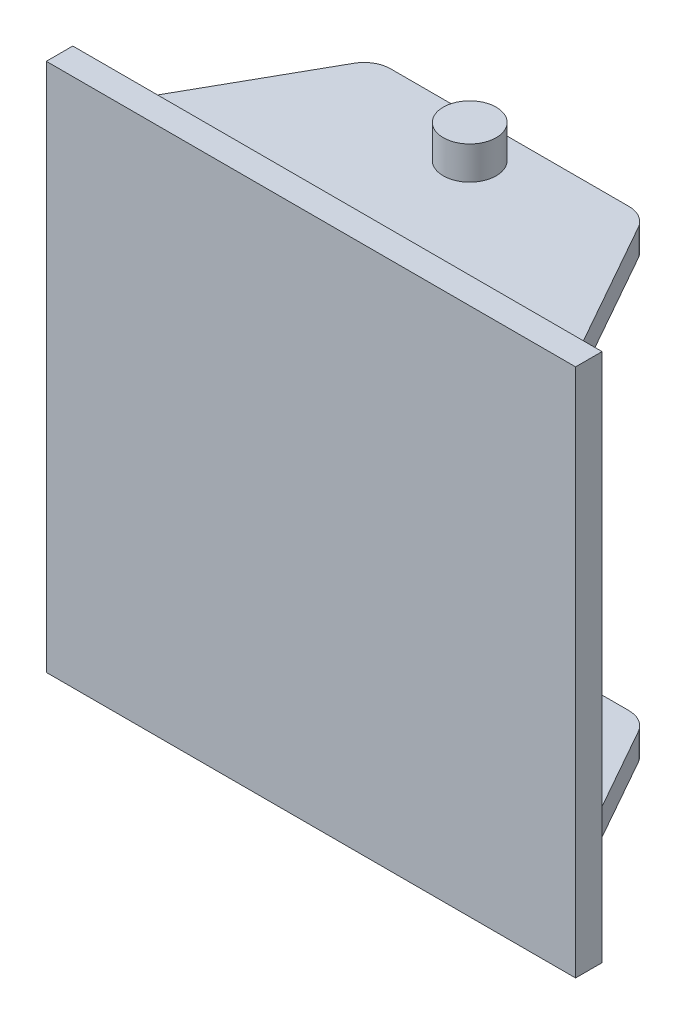
ISO-10303-21;
HEADER;
FILE_DESCRIPTION(('STEP AP214'),'2;1');
FILE_NAME('part.step','',(''),(''),'','','');
FILE_SCHEMA(('AUTOMOTIVE_DESIGN { 1 0 10303 214 1 1 1 1 }'));
ENDSEC;
DATA;
#1=APPLICATION_CONTEXT('core data for automotive mechanical design processes');
#2=APPLICATION_PROTOCOL_DEFINITION('international standard','automotive_design',2000,#1);
#3=PRODUCT_CONTEXT('',#1,'mechanical');
#4=PRODUCT('Part','Part','',(#3));
#5=PRODUCT_RELATED_PRODUCT_CATEGORY('part','',(#4));
#6=PRODUCT_DEFINITION_FORMATION('','',#4);
#7=PRODUCT_DEFINITION_CONTEXT('part definition',#1,'design');
#8=PRODUCT_DEFINITION('design','',#6,#7);
#9=PRODUCT_DEFINITION_SHAPE('','',#8);
#10=(LENGTH_UNIT() NAMED_UNIT(*) SI_UNIT(.MILLI.,.METRE.));
#11=(NAMED_UNIT(*) PLANE_ANGLE_UNIT() SI_UNIT($,.RADIAN.));
#12=(NAMED_UNIT(*) SI_UNIT($,.STERADIAN.) SOLID_ANGLE_UNIT());
#13=UNCERTAINTY_MEASURE_WITH_UNIT(LENGTH_MEASURE(1.E-05),#10,'distance_accuracy_value','');
#14=(GEOMETRIC_REPRESENTATION_CONTEXT(3) GLOBAL_UNCERTAINTY_ASSIGNED_CONTEXT((#13)) GLOBAL_UNIT_ASSIGNED_CONTEXT((#10,
#11,#12)) REPRESENTATION_CONTEXT('',''));
#15=CARTESIAN_POINT('',(0.,0.,0.));
#16=DIRECTION('',(0.,0.,1.));
#17=DIRECTION('',(1.,0.,0.));
#18=AXIS2_PLACEMENT_3D('',#15,#16,#17);
#19=CARTESIAN_POINT('',(45.,-100.,-55.0933602375957));
#20=DIRECTION('',(0.,1.,0.));
#21=DIRECTION('',(-1.,0.,0.));
#22=AXIS2_PLACEMENT_3D('',#19,#20,#21);
#23=CYLINDRICAL_SURFACE('',#22,10.);
#24=DIRECTION('',(0.,1.,0.));
#25=VECTOR('',#24,1.);
#26=CARTESIAN_POINT('',(45.,-100.,-65.0933602375957));
#27=LINE('',#26,#25);
#28=CARTESIAN_POINT('',(45.,-87.5,-65.0933602375957));
#29=VERTEX_POINT('',#28);
#30=CARTESIAN_POINT('',(45.,-77.5,-65.0933602375958));
#31=VERTEX_POINT('',#30);
#32=EDGE_CURVE('E193',#29,#31,#27,.T.);
#33=ORIENTED_EDGE('',*,*,#32,.T.);
#34=CARTESIAN_POINT('',(45.,-77.5,-55.0933602375957));
#35=DIRECTION('',(0.,-1.,0.));
#36=DIRECTION('',(0.,0.,-1.));
#37=AXIS2_PLACEMENT_3D('',#34,#35,#36);
#38=CIRCLE('',#37,10.);
#39=CARTESIAN_POINT('',(53.7134887526176,-77.5,-60.));
#40=VERTEX_POINT('',#39);
#41=EDGE_CURVE('E321',#31,#40,#38,.T.);
#42=ORIENTED_EDGE('',*,*,#41,.T.);
#43=DIRECTION('',(0.,1.,0.));
#44=VECTOR('',#43,1.);
#45=CARTESIAN_POINT('',(53.7134887526176,-100.,-60.));
#46=LINE('',#45,#44);
#47=CARTESIAN_POINT('',(53.7134887526176,-87.5,-60.));
#48=VERTEX_POINT('',#47);
#49=EDGE_CURVE('E201',#48,#40,#46,.T.);
#50=ORIENTED_EDGE('',*,*,#49,.F.);
#51=CARTESIAN_POINT('',(45.,-87.5,-55.0933602375957));
#52=DIRECTION('',(0.,1.,0.));
#53=DIRECTION('',(-1.,0.,0.));
#54=AXIS2_PLACEMENT_3D('',#51,#52,#53);
#55=CIRCLE('',#54,10.);
#56=EDGE_CURVE('E209',#29,#48,#55,.F.);
#57=ORIENTED_EDGE('',*,*,#56,.F.);
#58=EDGE_LOOP('',(#33,#42,#50,#57));
#59=FACE_BOUND('',#58,.T.);
#60=ADVANCED_FACE('F39',(#59),#23,.T.);
#61=CARTESIAN_POINT('',(-45.,-100.,-65.0933602375957));
#62=DIRECTION('',(0.,0.,1.));
#63=DIRECTION('',(1.,0.,0.));
#64=AXIS2_PLACEMENT_3D('',#61,#62,#63);
#65=PLANE('',#64);
#66=DIRECTION('',(0.,1.,0.));
#67=VECTOR('',#66,1.);
#68=CARTESIAN_POINT('',(-45.,-100.,-65.0933602375957));
#69=LINE('',#68,#67);
#70=CARTESIAN_POINT('',(-45.,-87.5,-65.0933602375957));
#71=VERTEX_POINT('',#70);
#72=CARTESIAN_POINT('',(-45.,-77.5,-65.0933602375958));
#73=VERTEX_POINT('',#72);
#74=EDGE_CURVE('E183',#71,#73,#69,.T.);
#75=ORIENTED_EDGE('',*,*,#74,.T.);
#76=DIRECTION('',(1.,0.,0.));
#77=VECTOR('',#76,1.);
#78=CARTESIAN_POINT('',(-100.,-77.5,-65.0933602375958));
#79=LINE('',#78,#77);
#80=EDGE_CURVE('E166',#73,#31,#79,.T.);
#81=ORIENTED_EDGE('',*,*,#80,.T.);
#82=ORIENTED_EDGE('',*,*,#32,.F.);
#83=DIRECTION('',(1.,0.,0.));
#84=VECTOR('',#83,1.);
#85=CARTESIAN_POINT('',(-87.5,-87.5,-65.0933602375957));
#86=LINE('',#85,#84);
#87=EDGE_CURVE('E205',#71,#29,#86,.T.);
#88=ORIENTED_EDGE('',*,*,#87,.F.);
#89=EDGE_LOOP('',(#75,#81,#82,#88));
#90=FACE_BOUND('',#89,.T.);
#91=ADVANCED_FACE('F373',(#90),#65,.F.);
#92=CARTESIAN_POINT('',(-45.,-100.,-55.0933602375957));
#93=DIRECTION('',(0.,1.,0.));
#94=DIRECTION('',(-1.,0.,0.));
#95=AXIS2_PLACEMENT_3D('',#92,#93,#94);
#96=CYLINDRICAL_SURFACE('',#95,10.);
#97=DIRECTION('',(0.,1.,0.));
#98=VECTOR('',#97,1.);
#99=CARTESIAN_POINT('',(-53.7134887526176,-100.,-60.));
#100=LINE('',#99,#98);
#101=CARTESIAN_POINT('',(-53.7134887526176,-87.5,-60.));
#102=VERTEX_POINT('',#101);
#103=CARTESIAN_POINT('',(-53.7134887526176,-77.5,-60.));
#104=VERTEX_POINT('',#103);
#105=EDGE_CURVE('E184',#102,#104,#100,.T.);
#106=ORIENTED_EDGE('',*,*,#105,.T.);
#107=CARTESIAN_POINT('',(-45.,-77.5,-55.0933602375957));
#108=DIRECTION('',(0.,-1.,0.));
#109=DIRECTION('',(0.,0.,-1.));
#110=AXIS2_PLACEMENT_3D('',#107,#108,#109);
#111=CIRCLE('',#110,10.);
#112=EDGE_CURVE('E317',#104,#73,#111,.T.);
#113=ORIENTED_EDGE('',*,*,#112,.T.);
#114=ORIENTED_EDGE('',*,*,#74,.F.);
#115=CARTESIAN_POINT('',(-45.,-87.5,-55.0933602375957));
#116=DIRECTION('',(0.,1.,0.));
#117=DIRECTION('',(-1.,0.,0.));
#118=AXIS2_PLACEMENT_3D('',#115,#116,#117);
#119=CIRCLE('',#118,10.);
#120=EDGE_CURVE('E200',#102,#71,#119,.F.);
#121=ORIENTED_EDGE('',*,*,#120,.F.);
#122=EDGE_LOOP('',(#106,#113,#114,#121));
#123=FACE_BOUND('',#122,.T.);
#124=ADVANCED_FACE('F376',(#123),#96,.T.);
#125=CARTESIAN_POINT('',(-100.,100.,10.));
#126=DIRECTION('',(1.,0.,0.));
#127=DIRECTION('',(0.,1.,0.));
#128=AXIS2_PLACEMENT_3D('',#125,#126,#127);
#129=PLANE('',#128);
#130=DIRECTION('',(0.,-1.,0.));
#131=VECTOR('',#130,1.);
#132=CARTESIAN_POINT('',(-100.,100.,0.));
#133=LINE('',#132,#131);
#134=CARTESIAN_POINT('',(-100.,100.,0.));
#135=VERTEX_POINT('',#134);
#136=CARTESIAN_POINT('',(-100.,-100.,0.));
#137=VERTEX_POINT('',#136);
#138=EDGE_CURVE('E230',#135,#137,#133,.T.);
#139=ORIENTED_EDGE('',*,*,#138,.T.);
#140=DIRECTION('',(0.,0.,-1.));
#141=VECTOR('',#140,1.);
#142=CARTESIAN_POINT('',(-100.,-100.,10.));
#143=LINE('',#142,#141);
#144=CARTESIAN_POINT('',(-100.,-100.,10.));
#145=VERTEX_POINT('',#144);
#146=EDGE_CURVE('E268',#145,#137,#143,.T.);
#147=ORIENTED_EDGE('',*,*,#146,.F.);
#148=DIRECTION('',(0.,-1.,0.));
#149=VECTOR('',#148,1.);
#150=CARTESIAN_POINT('',(-100.,100.,10.));
#151=LINE('',#150,#149);
#152=CARTESIAN_POINT('',(-100.,100.,10.));
#153=VERTEX_POINT('',#152);
#154=EDGE_CURVE('E231',#153,#145,#151,.T.);
#155=ORIENTED_EDGE('',*,*,#154,.F.);
#156=DIRECTION('',(0.,0.,-1.));
#157=VECTOR('',#156,1.);
#158=CARTESIAN_POINT('',(-100.,100.,10.));
#159=LINE('',#158,#157);
#160=EDGE_CURVE('E245',#153,#135,#159,.T.);
#161=ORIENTED_EDGE('',*,*,#160,.T.);
#162=EDGE_LOOP('',(#139,#147,#155,#161));
#163=FACE_BOUND('',#162,.T.);
#164=ADVANCED_FACE('F41',(#163),#129,.F.);
#165=CARTESIAN_POINT('',(100.,-100.,10.));
#166=DIRECTION('',(0.,1.,0.));
#167=DIRECTION('',(-1.,0.,0.));
#168=AXIS2_PLACEMENT_3D('',#165,#166,#167);
#169=PLANE('',#168);
#170=DIRECTION('',(1.,0.,0.));
#171=VECTOR('',#170,1.);
#172=CARTESIAN_POINT('',(100.,-100.,0.));
#173=LINE('',#172,#171);
#174=CARTESIAN_POINT('',(100.,-100.,0.));
#175=VERTEX_POINT('',#174);
#176=EDGE_CURVE('E249',#137,#175,#173,.T.);
#177=ORIENTED_EDGE('',*,*,#176,.T.);
#178=DIRECTION('',(0.,0.,-1.));
#179=VECTOR('',#178,1.);
#180=CARTESIAN_POINT('',(100.,-100.,10.));
#181=LINE('',#180,#179);
#182=CARTESIAN_POINT('',(100.,-100.,10.));
#183=VERTEX_POINT('',#182);
#184=EDGE_CURVE('E264',#183,#175,#181,.T.);
#185=ORIENTED_EDGE('',*,*,#184,.F.);
#186=DIRECTION('',(1.,0.,0.));
#187=VECTOR('',#186,1.);
#188=CARTESIAN_POINT('',(100.,-100.,10.));
#189=LINE('',#188,#187);
#190=EDGE_CURVE('E235',#145,#183,#189,.T.);
#191=ORIENTED_EDGE('',*,*,#190,.F.);
#192=ORIENTED_EDGE('',*,*,#146,.T.);
#193=EDGE_LOOP('',(#177,#185,#191,#192));
#194=FACE_BOUND('',#193,.T.);
#195=ADVANCED_FACE('F450',(#194),#169,.F.);
#196=CARTESIAN_POINT('',(100.,100.,10.));
#197=DIRECTION('',(-1.,0.,0.));
#198=DIRECTION('',(0.,-1.,0.));
#199=AXIS2_PLACEMENT_3D('',#196,#197,#198);
#200=PLANE('',#199);
#201=DIRECTION('',(0.,1.,0.));
#202=VECTOR('',#201,1.);
#203=CARTESIAN_POINT('',(100.,100.,0.));
#204=LINE('',#203,#202);
#205=CARTESIAN_POINT('',(100.,100.,0.));
#206=VERTEX_POINT('',#205);
#207=EDGE_CURVE('E252',#175,#206,#204,.T.);
#208=ORIENTED_EDGE('',*,*,#207,.T.);
#209=DIRECTION('',(0.,0.,-1.));
#210=VECTOR('',#209,1.);
#211=CARTESIAN_POINT('',(100.,100.,10.));
#212=LINE('',#211,#210);
#213=CARTESIAN_POINT('',(100.,100.,10.));
#214=VERTEX_POINT('',#213);
#215=EDGE_CURVE('E260',#214,#206,#212,.T.);
#216=ORIENTED_EDGE('',*,*,#215,.F.);
#217=DIRECTION('',(0.,1.,0.));
#218=VECTOR('',#217,1.);
#219=CARTESIAN_POINT('',(100.,100.,10.));
#220=LINE('',#219,#218);
#221=EDGE_CURVE('E239',#183,#214,#220,.T.);
#222=ORIENTED_EDGE('',*,*,#221,.F.);
#223=ORIENTED_EDGE('',*,*,#184,.T.);
#224=EDGE_LOOP('',(#208,#216,#222,#223));
#225=FACE_BOUND('',#224,.T.);
#226=ADVANCED_FACE('F447',(#225),#200,.F.);
#227=CARTESIAN_POINT('',(100.,100.,10.));
#228=DIRECTION('',(0.,-1.,0.));
#229=DIRECTION('',(1.,0.,0.));
#230=AXIS2_PLACEMENT_3D('',#227,#228,#229);
#231=PLANE('',#230);
#232=DIRECTION('',(-1.,0.,0.));
#233=VECTOR('',#232,1.);
#234=CARTESIAN_POINT('',(100.,100.,0.));
#235=LINE('',#234,#233);
#236=EDGE_CURVE('E236',#206,#135,#235,.T.);
#237=ORIENTED_EDGE('',*,*,#236,.T.);
#238=ORIENTED_EDGE('',*,*,#160,.F.);
#239=DIRECTION('',(-1.,0.,0.));
#240=VECTOR('',#239,1.);
#241=CARTESIAN_POINT('',(100.,100.,10.));
#242=LINE('',#241,#240);
#243=EDGE_CURVE('E242',#214,#153,#242,.T.);
#244=ORIENTED_EDGE('',*,*,#243,.F.);
#245=ORIENTED_EDGE('',*,*,#215,.T.);
#246=EDGE_LOOP('',(#237,#238,#244,#245));
#247=FACE_BOUND('',#246,.T.);
#248=ADVANCED_FACE('F441',(#247),#231,.F.);
#249=CARTESIAN_POINT('',(0.,0.,10.));
#250=DIRECTION('',(0.,0.,-1.));
#251=DIRECTION('',(-1.,0.,0.));
#252=AXIS2_PLACEMENT_3D('',#249,#250,#251);
#253=PLANE('',#252);
#254=ORIENTED_EDGE('',*,*,#154,.T.);
#255=ORIENTED_EDGE('',*,*,#190,.T.);
#256=ORIENTED_EDGE('',*,*,#221,.T.);
#257=ORIENTED_EDGE('',*,*,#243,.T.);
#258=EDGE_LOOP('',(#254,#255,#256,#257));
#259=FACE_BOUND('',#258,.T.);
#260=ADVANCED_FACE('F438',(#259),#253,.F.);
#261=CARTESIAN_POINT('',(0.,0.,0.));
#262=DIRECTION('',(0.,0.,-1.));
#263=DIRECTION('',(-1.,0.,0.));
#264=AXIS2_PLACEMENT_3D('',#261,#262,#263);
#265=PLANE('',#264);
#266=DIRECTION('',(-1.,0.,0.));
#267=VECTOR('',#266,1.);
#268=CARTESIAN_POINT('',(-87.5,-87.5,0.));
#269=LINE('',#268,#267);
#270=CARTESIAN_POINT('',(87.5,-87.5,0.));
#271=VERTEX_POINT('',#270);
#272=CARTESIAN_POINT('',(-87.5,-87.5,0.));
#273=VERTEX_POINT('',#272);
#274=EDGE_CURVE('E220',#271,#273,#269,.T.);
#275=ORIENTED_EDGE('',*,*,#274,.F.);
#276=DIRECTION('',(0.,-1.,0.));
#277=VECTOR('',#276,1.);
#278=CARTESIAN_POINT('',(87.5,87.5,0.));
#279=LINE('',#278,#277);
#280=CARTESIAN_POINT('',(87.5,87.5,0.));
#281=VERTEX_POINT('',#280);
#282=EDGE_CURVE('E217',#281,#271,#279,.T.);
#283=ORIENTED_EDGE('',*,*,#282,.F.);
#284=DIRECTION('',(1.,0.,0.));
#285=VECTOR('',#284,1.);
#286=CARTESIAN_POINT('',(-87.5,87.5,0.));
#287=LINE('',#286,#285);
#288=CARTESIAN_POINT('',(-87.5,87.5,0.));
#289=VERTEX_POINT('',#288);
#290=EDGE_CURVE('E226',#289,#281,#287,.T.);
#291=ORIENTED_EDGE('',*,*,#290,.F.);
#292=DIRECTION('',(0.,1.,0.));
#293=VECTOR('',#292,1.);
#294=CARTESIAN_POINT('',(-87.5,87.5,0.));
#295=LINE('',#294,#293);
#296=EDGE_CURVE('E65',#273,#289,#295,.T.);
#297=ORIENTED_EDGE('',*,*,#296,.F.);
#298=EDGE_LOOP('',(#275,#283,#291,#297));
#299=FACE_BOUND('',#298,.T.);
#300=ORIENTED_EDGE('',*,*,#207,.F.);
#301=ORIENTED_EDGE('',*,*,#176,.F.);
#302=ORIENTED_EDGE('',*,*,#138,.F.);
#303=ORIENTED_EDGE('',*,*,#236,.F.);
#304=EDGE_LOOP('',(#300,#301,#302,#303));
#305=FACE_BOUND('',#304,.T.);
#306=ADVANCED_FACE('F366',(#299,#305),#265,.T.);
#307=CARTESIAN_POINT('',(-87.5,-87.5,-75.));
#308=DIRECTION('',(0.,1.,0.));
#309=DIRECTION('',(-1.,0.,0.));
#310=AXIS2_PLACEMENT_3D('',#307,#308,#309);
#311=PLANE('',#310);
#312=CARTESIAN_POINT('',(0.,-87.5,-50.));
#313=DIRECTION('',(0.,1.,0.));
#314=DIRECTION('',(-1.,0.,0.));
#315=AXIS2_PLACEMENT_3D('',#312,#313,#314);
#316=CIRCLE('',#315,10.);
#317=CARTESIAN_POINT('',(-10.,-87.5,-50.));
#318=VERTEX_POINT('',#317);
#319=EDGE_CURVE('E11',#318,#318,#316,.F.);
#320=ORIENTED_EDGE('',*,*,#319,.F.);
#321=EDGE_LOOP('',(#320));
#322=FACE_BOUND('',#321,.T.);
#323=ORIENTED_EDGE('',*,*,#56,.T.);
#324=DIRECTION('',(0.490663976240425,0.,0.871348875261761));
#325=VECTOR('',#324,1.);
#326=CARTESIAN_POINT('',(13.303088136347,-87.5,-131.763077851493));
#327=LINE('',#326,#325);
#328=EDGE_CURVE('E213',#48,#271,#327,.T.);
#329=ORIENTED_EDGE('',*,*,#328,.T.);
#330=ORIENTED_EDGE('',*,*,#274,.T.);
#331=DIRECTION('',(0.490663976240425,0.,-0.871348875261761));
#332=VECTOR('',#331,1.);
#333=CARTESIAN_POINT('',(-55.4345372128582,-87.5,-56.9436646814952));
#334=LINE('',#333,#332);
#335=EDGE_CURVE('E196',#273,#102,#334,.T.);
#336=ORIENTED_EDGE('',*,*,#335,.T.);
#337=ORIENTED_EDGE('',*,*,#120,.T.);
#338=ORIENTED_EDGE('',*,*,#87,.T.);
#339=EDGE_LOOP('',(#323,#329,#330,#336,#337,#338));
#340=FACE_BOUND('',#339,.T.);
#341=ADVANCED_FACE('F369',(#322,#340),#311,.F.);
#342=CARTESIAN_POINT('',(-87.5,87.5,-75.));
#343=DIRECTION('',(0.,-1.,0.));
#344=DIRECTION('',(1.,0.,0.));
#345=AXIS2_PLACEMENT_3D('',#342,#343,#344);
#346=PLANE('',#345);
#347=CARTESIAN_POINT('',(0.,87.5,-50.));
#348=DIRECTION('',(0.,-1.,0.));
#349=DIRECTION('',(1.,0.,0.));
#350=AXIS2_PLACEMENT_3D('',#347,#348,#349);
#351=CIRCLE('',#350,10.);
#352=CARTESIAN_POINT('',(10.,87.5,-50.));
#353=VERTEX_POINT('',#352);
#354=EDGE_CURVE('E49',#353,#353,#351,.F.);
#355=ORIENTED_EDGE('',*,*,#354,.F.);
#356=EDGE_LOOP('',(#355));
#357=FACE_BOUND('',#356,.T.);
#358=ORIENTED_EDGE('',*,*,#290,.T.);
#359=DIRECTION('',(0.490663976240425,0.,0.871348875261761));
#360=VECTOR('',#359,1.);
#361=CARTESIAN_POINT('',(87.5,87.5,0.));
#362=LINE('',#361,#360);
#363=CARTESIAN_POINT('',(53.7134887526176,87.5,-60.));
#364=VERTEX_POINT('',#363);
#365=EDGE_CURVE('E341',#364,#281,#362,.T.);
#366=ORIENTED_EDGE('',*,*,#365,.F.);
#367=CARTESIAN_POINT('',(45.,87.5,-55.0933602375957));
#368=DIRECTION('',(0.,-1.,0.));
#369=DIRECTION('',(1.,0.,0.));
#370=AXIS2_PLACEMENT_3D('',#367,#368,#369);
#371=CIRCLE('',#370,10.);
#372=CARTESIAN_POINT('',(45.,87.5,-65.0933602375957));
#373=VERTEX_POINT('',#372);
#374=EDGE_CURVE('E337',#373,#364,#371,.T.);
#375=ORIENTED_EDGE('',*,*,#374,.F.);
#376=DIRECTION('',(1.,0.,0.));
#377=VECTOR('',#376,1.);
#378=CARTESIAN_POINT('',(-45.,87.5,-65.0933602375957));
#379=LINE('',#378,#377);
#380=CARTESIAN_POINT('',(-45.,87.5,-65.0933602375957));
#381=VERTEX_POINT('',#380);
#382=EDGE_CURVE('E334',#381,#373,#379,.T.);
#383=ORIENTED_EDGE('',*,*,#382,.F.);
#384=CARTESIAN_POINT('',(-45.,87.5,-55.0933602375957));
#385=DIRECTION('',(0.,-1.,0.));
#386=DIRECTION('',(-1.,0.,0.));
#387=AXIS2_PLACEMENT_3D('',#384,#385,#386);
#388=CIRCLE('',#387,10.);
#389=CARTESIAN_POINT('',(-53.7134887526176,87.5,-60.));
#390=VERTEX_POINT('',#389);
#391=EDGE_CURVE('E180',#390,#381,#388,.T.);
#392=ORIENTED_EDGE('',*,*,#391,.F.);
#393=DIRECTION('',(0.490663976240425,0.,-0.871348875261761));
#394=VECTOR('',#393,1.);
#395=CARTESIAN_POINT('',(-87.5,87.5,0.));
#396=LINE('',#395,#394);
#397=EDGE_CURVE('E329',#289,#390,#396,.T.);
#398=ORIENTED_EDGE('',*,*,#397,.F.);
#399=EDGE_LOOP('',(#358,#366,#375,#383,#392,#398));
#400=FACE_BOUND('',#399,.T.);
#401=ADVANCED_FACE('F360',(#357,#400),#346,.F.);
#402=CARTESIAN_POINT('',(87.5,-100.,0.));
#403=DIRECTION('',(-0.871348875261761,0.,0.490663976240425));
#404=DIRECTION('',(0.490663976240425,0.,0.871348875261761));
#405=AXIS2_PLACEMENT_3D('',#402,#403,#404);
#406=PLANE('',#405);
#407=ORIENTED_EDGE('',*,*,#49,.T.);
#408=DIRECTION('',(0.490663976240425,0.,0.871348875261761));
#409=VECTOR('',#408,1.);
#410=CARTESIAN_POINT('',(87.5,-77.5,0.));
#411=LINE('',#410,#409);
#412=CARTESIAN_POINT('',(79.0533721881544,-77.5,-15.));
#413=VERTEX_POINT('',#412);
#414=EDGE_CURVE('E325',#40,#413,#411,.T.);
#415=ORIENTED_EDGE('',*,*,#414,.T.);
#416=DIRECTION('',(0.,1.,0.));
#417=VECTOR('',#416,1.);
#418=CARTESIAN_POINT('',(79.0533721881544,-100.,-15.));
#419=LINE('',#418,#417);
#420=CARTESIAN_POINT('',(79.0533721881544,77.5,-15.));
#421=VERTEX_POINT('',#420);
#422=EDGE_CURVE('E313',#413,#421,#419,.T.);
#423=ORIENTED_EDGE('',*,*,#422,.T.);
#424=DIRECTION('',(-0.490663976240425,0.,-0.871348875261761));
#425=VECTOR('',#424,1.);
#426=CARTESIAN_POINT('',(87.5,77.5,0.));
#427=LINE('',#426,#425);
#428=CARTESIAN_POINT('',(53.7134887526176,77.5,-60.));
#429=VERTEX_POINT('',#428);
#430=EDGE_CURVE('E309',#421,#429,#427,.T.);
#431=ORIENTED_EDGE('',*,*,#430,.T.);
#432=EDGE_CURVE('E345',#429,#364,#46,.T.);
#433=ORIENTED_EDGE('',*,*,#432,.T.);
#434=ORIENTED_EDGE('',*,*,#365,.T.);
#435=ORIENTED_EDGE('',*,*,#282,.T.);
#436=ORIENTED_EDGE('',*,*,#328,.F.);
#437=EDGE_LOOP('',(#407,#415,#423,#431,#433,#434,#435,#436));
#438=FACE_BOUND('',#437,.T.);
#439=ADVANCED_FACE('F363',(#438),#406,.F.);
#440=ORIENTED_EDGE('',*,*,#432,.F.);
#441=CARTESIAN_POINT('',(45.,77.5,-55.0933602375957));
#442=DIRECTION('',(0.,1.,0.));
#443=DIRECTION('',(0.,0.,1.));
#444=AXIS2_PLACEMENT_3D('',#441,#442,#443);
#445=CIRCLE('',#444,10.);
#446=CARTESIAN_POINT('',(45.,77.5,-65.0933602375957));
#447=VERTEX_POINT('',#446);
#448=EDGE_CURVE('E165',#429,#447,#445,.T.);
#449=ORIENTED_EDGE('',*,*,#448,.T.);
#450=EDGE_CURVE('E174',#447,#373,#27,.T.);
#451=ORIENTED_EDGE('',*,*,#450,.T.);
#452=ORIENTED_EDGE('',*,*,#374,.T.);
#453=EDGE_LOOP('',(#440,#449,#451,#452));
#454=FACE_BOUND('',#453,.T.);
#455=ADVANCED_FACE('F356',(#454),#23,.T.);
#456=ORIENTED_EDGE('',*,*,#450,.F.);
#457=DIRECTION('',(1.,0.,0.));
#458=VECTOR('',#457,1.);
#459=CARTESIAN_POINT('',(-100.,77.5,-65.0933602375957));
#460=LINE('',#459,#458);
#461=CARTESIAN_POINT('',(-45.,77.5,-65.0933602375957));
#462=VERTEX_POINT('',#461);
#463=EDGE_CURVE('E157',#462,#447,#460,.T.);
#464=ORIENTED_EDGE('',*,*,#463,.F.);
#465=EDGE_CURVE('E172',#462,#381,#69,.T.);
#466=ORIENTED_EDGE('',*,*,#465,.T.);
#467=ORIENTED_EDGE('',*,*,#382,.T.);
#468=EDGE_LOOP('',(#456,#464,#466,#467));
#469=FACE_BOUND('',#468,.T.);
#470=ADVANCED_FACE('F170',(#469),#65,.F.);
#471=ORIENTED_EDGE('',*,*,#465,.F.);
#472=CARTESIAN_POINT('',(-45.,77.5,-55.0933602375957));
#473=DIRECTION('',(0.,1.,0.));
#474=DIRECTION('',(0.,0.,1.));
#475=AXIS2_PLACEMENT_3D('',#472,#473,#474);
#476=CIRCLE('',#475,10.);
#477=CARTESIAN_POINT('',(-53.7134887526176,77.5,-60.));
#478=VERTEX_POINT('',#477);
#479=EDGE_CURVE('E154',#462,#478,#476,.T.);
#480=ORIENTED_EDGE('',*,*,#479,.T.);
#481=EDGE_CURVE('E190',#478,#390,#100,.T.);
#482=ORIENTED_EDGE('',*,*,#481,.T.);
#483=ORIENTED_EDGE('',*,*,#391,.T.);
#484=EDGE_LOOP('',(#471,#480,#482,#483));
#485=FACE_BOUND('',#484,.T.);
#486=ADVANCED_FACE('F178',(#485),#96,.T.);
#487=CARTESIAN_POINT('',(-87.5,-100.,0.));
#488=DIRECTION('',(0.871348875261761,0.,0.490663976240425));
#489=DIRECTION('',(0.490663976240425,0.,-0.871348875261761));
#490=AXIS2_PLACEMENT_3D('',#487,#488,#489);
#491=PLANE('',#490);
#492=DIRECTION('',(0.,-1.,0.));
#493=VECTOR('',#492,1.);
#494=CARTESIAN_POINT('',(-79.0533721881544,-100.,-15.));
#495=LINE('',#494,#493);
#496=CARTESIAN_POINT('',(-79.0533721881544,77.5,-15.));
#497=VERTEX_POINT('',#496);
#498=CARTESIAN_POINT('',(-79.0533721881544,-77.5,-15.));
#499=VERTEX_POINT('',#498);
#500=EDGE_CURVE('E274',#497,#499,#495,.T.);
#501=ORIENTED_EDGE('',*,*,#500,.T.);
#502=DIRECTION('',(0.490663976240425,0.,-0.871348875261761));
#503=VECTOR('',#502,1.);
#504=CARTESIAN_POINT('',(-87.5,-77.5,0.));
#505=LINE('',#504,#503);
#506=EDGE_CURVE('E277',#499,#104,#505,.T.);
#507=ORIENTED_EDGE('',*,*,#506,.T.);
#508=ORIENTED_EDGE('',*,*,#105,.F.);
#509=ORIENTED_EDGE('',*,*,#335,.F.);
#510=ORIENTED_EDGE('',*,*,#296,.T.);
#511=ORIENTED_EDGE('',*,*,#397,.T.);
#512=ORIENTED_EDGE('',*,*,#481,.F.);
#513=DIRECTION('',(-0.490663976240425,0.,0.871348875261761));
#514=VECTOR('',#513,1.);
#515=CARTESIAN_POINT('',(-87.5,77.5,0.));
#516=LINE('',#515,#514);
#517=EDGE_CURVE('E160',#478,#497,#516,.T.);
#518=ORIENTED_EDGE('',*,*,#517,.T.);
#519=EDGE_LOOP('',(#501,#507,#508,#509,#510,#511,#512,#518));
#520=FACE_BOUND('',#519,.T.);
#521=ADVANCED_FACE('F380',(#520),#491,.F.);
#522=CARTESIAN_POINT('',(-100.,-77.5,-65.0933602375958));
#523=DIRECTION('',(0.,-1.,0.));
#524=DIRECTION('',(0.,0.,-1.));
#525=AXIS2_PLACEMENT_3D('',#522,#523,#524);
#526=PLANE('',#525);
#527=CARTESIAN_POINT('',(0.,-77.5,-50.));
#528=DIRECTION('',(0.,-1.,0.));
#529=DIRECTION('',(0.,0.,-1.));
#530=AXIS2_PLACEMENT_3D('',#527,#528,#529);
#531=CIRCLE('',#530,10.);
#532=CARTESIAN_POINT('',(0.,-77.5,-60.));
#533=VERTEX_POINT('',#532);
#534=EDGE_CURVE('E283',#533,#533,#531,.F.);
#535=ORIENTED_EDGE('',*,*,#534,.F.);
#536=EDGE_LOOP('',(#535));
#537=FACE_BOUND('',#536,.T.);
#538=ORIENTED_EDGE('',*,*,#41,.F.);
#539=ORIENTED_EDGE('',*,*,#80,.F.);
#540=ORIENTED_EDGE('',*,*,#112,.F.);
#541=ORIENTED_EDGE('',*,*,#506,.F.);
#542=DIRECTION('',(1.,0.,0.));
#543=VECTOR('',#542,1.);
#544=CARTESIAN_POINT('',(-100.,-77.5,-15.));
#545=LINE('',#544,#543);
#546=EDGE_CURVE('E301',#499,#413,#545,.T.);
#547=ORIENTED_EDGE('',*,*,#546,.T.);
#548=ORIENTED_EDGE('',*,*,#414,.F.);
#549=EDGE_LOOP('',(#538,#539,#540,#541,#547,#548));
#550=FACE_BOUND('',#549,.T.);
#551=ADVANCED_FACE('F371',(#537,#550),#526,.F.);
#552=CARTESIAN_POINT('',(-100.,77.5,-15.));
#553=DIRECTION('',(0.,0.,1.));
#554=DIRECTION('',(0.,-1.,0.));
#555=AXIS2_PLACEMENT_3D('',#552,#553,#554);
#556=PLANE('',#555);
#557=ORIENTED_EDGE('',*,*,#546,.F.);
#558=ORIENTED_EDGE('',*,*,#500,.F.);
#559=DIRECTION('',(1.,0.,0.));
#560=VECTOR('',#559,1.);
#561=CARTESIAN_POINT('',(-100.,77.5,-15.));
#562=LINE('',#561,#560);
#563=EDGE_CURVE('E57',#497,#421,#562,.T.);
#564=ORIENTED_EDGE('',*,*,#563,.T.);
#565=ORIENTED_EDGE('',*,*,#422,.F.);
#566=EDGE_LOOP('',(#557,#558,#564,#565));
#567=FACE_BOUND('',#566,.T.);
#568=ADVANCED_FACE('F379',(#567),#556,.F.);
#569=CARTESIAN_POINT('',(-100.,77.5,-65.0933602375957));
#570=DIRECTION('',(0.,1.,0.));
#571=DIRECTION('',(0.,0.,1.));
#572=AXIS2_PLACEMENT_3D('',#569,#570,#571);
#573=PLANE('',#572);
#574=CARTESIAN_POINT('',(0.,77.5,-50.));
#575=DIRECTION('',(0.,1.,0.));
#576=DIRECTION('',(0.,0.,1.));
#577=AXIS2_PLACEMENT_3D('',#574,#575,#576);
#578=CIRCLE('',#577,10.);
#579=CARTESIAN_POINT('',(0.,77.5,-40.));
#580=VERTEX_POINT('',#579);
#581=EDGE_CURVE('E43',#580,#580,#578,.F.);
#582=ORIENTED_EDGE('',*,*,#581,.F.);
#583=EDGE_LOOP('',(#582));
#584=FACE_BOUND('',#583,.T.);
#585=ORIENTED_EDGE('',*,*,#563,.F.);
#586=ORIENTED_EDGE('',*,*,#517,.F.);
#587=ORIENTED_EDGE('',*,*,#479,.F.);
#588=ORIENTED_EDGE('',*,*,#463,.T.);
#589=ORIENTED_EDGE('',*,*,#448,.F.);
#590=ORIENTED_EDGE('',*,*,#430,.F.);
#591=EDGE_LOOP('',(#585,#586,#587,#588,#589,#590));
#592=FACE_BOUND('',#591,.T.);
#593=ADVANCED_FACE('F156',(#584,#592),#573,.F.);
#594=CARTESIAN_POINT('',(0.,100.,-50.));
#595=DIRECTION('',(0.,-1.,0.));
#596=DIRECTION('',(0.,0.,-1.));
#597=AXIS2_PLACEMENT_3D('',#594,#595,#596);
#598=CYLINDRICAL_SURFACE('',#597,10.);
#599=ORIENTED_EDGE('',*,*,#581,.T.);
#600=EDGE_LOOP('',(#599));
#601=FACE_BOUND('',#600,.T.);
#602=ORIENTED_EDGE('',*,*,#534,.T.);
#603=EDGE_LOOP('',(#602));
#604=FACE_BOUND('',#603,.T.);
#605=ADVANCED_FACE('F399',(#601,#604),#598,.T.);
#606=CARTESIAN_POINT('',(0.,100.,-50.));
#607=DIRECTION('',(0.,1.,0.));
#608=DIRECTION('',(0.,0.,1.));
#609=AXIS2_PLACEMENT_3D('',#606,#607,#608);
#610=PLANE('',#609);
#611=CARTESIAN_POINT('',(0.,100.,-50.));
#612=DIRECTION('',(0.,1.,0.));
#613=DIRECTION('',(0.,0.,1.));
#614=AXIS2_PLACEMENT_3D('',#611,#612,#613);
#615=CIRCLE('',#614,10.);
#616=CARTESIAN_POINT('',(0.,100.,-40.));
#617=VERTEX_POINT('',#616);
#618=EDGE_CURVE('E176',#617,#617,#615,.T.);
#619=ORIENTED_EDGE('',*,*,#618,.T.);
#620=EDGE_LOOP('',(#619));
#621=FACE_BOUND('',#620,.T.);
#622=ADVANCED_FACE('F545',(#621),#610,.T.);
#623=ORIENTED_EDGE('',*,*,#618,.F.);
#624=EDGE_LOOP('',(#623));
#625=FACE_BOUND('',#624,.T.);
#626=ORIENTED_EDGE('',*,*,#354,.T.);
#627=EDGE_LOOP('',(#626));
#628=FACE_BOUND('',#627,.T.);
#629=ADVANCED_FACE('F397',(#625,#628),#598,.T.);
#630=CARTESIAN_POINT('',(0.,-100.,-50.));
#631=DIRECTION('',(0.,1.,0.));
#632=DIRECTION('',(0.,0.,1.));
#633=AXIS2_PLACEMENT_3D('',#630,#631,#632);
#634=CIRCLE('',#633,10.);
#635=CARTESIAN_POINT('',(0.,-100.,-40.));
#636=VERTEX_POINT('',#635);
#637=EDGE_CURVE('E295',#636,#636,#634,.T.);
#638=ORIENTED_EDGE('',*,*,#637,.T.);
#639=EDGE_LOOP('',(#638));
#640=FACE_BOUND('',#639,.T.);
#641=ORIENTED_EDGE('',*,*,#319,.T.);
#642=EDGE_LOOP('',(#641));
#643=FACE_BOUND('',#642,.T.);
#644=ADVANCED_FACE('F388',(#640,#643),#598,.T.);
#645=CARTESIAN_POINT('',(0.,-100.,-50.));
#646=DIRECTION('',(0.,1.,0.));
#647=DIRECTION('',(0.,0.,1.));
#648=AXIS2_PLACEMENT_3D('',#645,#646,#647);
#649=PLANE('',#648);
#650=ORIENTED_EDGE('',*,*,#637,.F.);
#651=EDGE_LOOP('',(#650));
#652=FACE_BOUND('',#651,.T.);
#653=ADVANCED_FACE('F391',(#652),#649,.F.);
#654=CLOSED_SHELL('',(#60,#91,#124,#164,#195,#226,#248,#260,#306,#341,#401,#439,#455,#470,#486,
#521,#551,#568,#593,#605,#622,#629,#644,#653));
#655=MANIFOLD_SOLID_BREP('B2',#654);
#656=ADVANCED_BREP_SHAPE_REPRESENTATION('',(#18,#655),#14);
#657=SHAPE_DEFINITION_REPRESENTATION(#9,#656);
ENDSEC;
END-ISO-10303-21;
